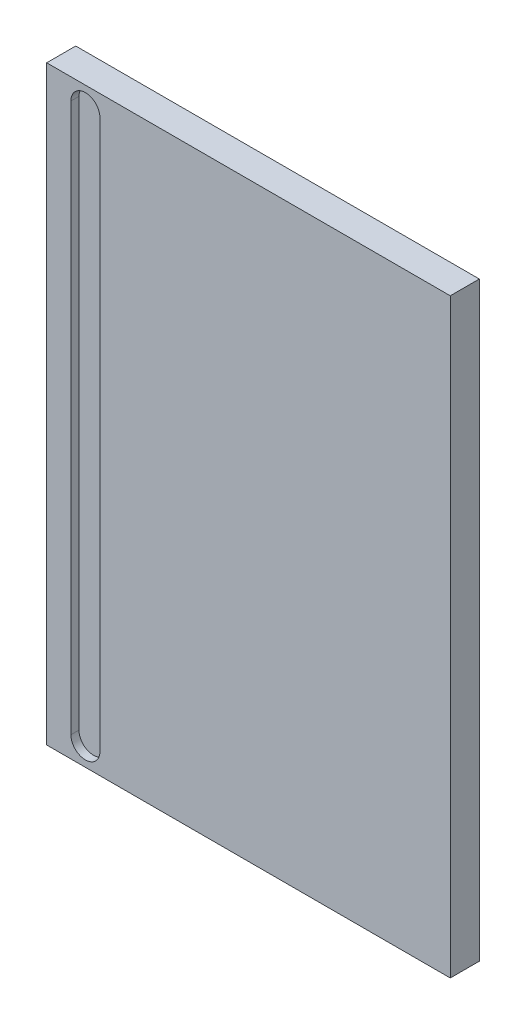
ISO-10303-21;
HEADER;
FILE_DESCRIPTION(('STEP AP214'),'2;1');
FILE_NAME('part.step','',(''),(''),'','','');
FILE_SCHEMA(('AUTOMOTIVE_DESIGN { 1 0 10303 214 1 1 1 1 }'));
ENDSEC;
DATA;
#1=APPLICATION_CONTEXT('core data for automotive mechanical design processes');
#2=APPLICATION_PROTOCOL_DEFINITION('international standard','automotive_design',2000,#1);
#3=PRODUCT_CONTEXT('',#1,'mechanical');
#4=PRODUCT('Part','Part','',(#3));
#5=PRODUCT_RELATED_PRODUCT_CATEGORY('part','',(#4));
#6=PRODUCT_DEFINITION_FORMATION('','',#4);
#7=PRODUCT_DEFINITION_CONTEXT('part definition',#1,'design');
#8=PRODUCT_DEFINITION('design','',#6,#7);
#9=PRODUCT_DEFINITION_SHAPE('','',#8);
#10=(LENGTH_UNIT() NAMED_UNIT(*) SI_UNIT(.MILLI.,.METRE.));
#11=(NAMED_UNIT(*) PLANE_ANGLE_UNIT() SI_UNIT($,.RADIAN.));
#12=(NAMED_UNIT(*) SI_UNIT($,.STERADIAN.) SOLID_ANGLE_UNIT());
#13=UNCERTAINTY_MEASURE_WITH_UNIT(LENGTH_MEASURE(1.E-05),#10,'distance_accuracy_value','');
#14=(GEOMETRIC_REPRESENTATION_CONTEXT(3) GLOBAL_UNCERTAINTY_ASSIGNED_CONTEXT((#13)) GLOBAL_UNIT_ASSIGNED_CONTEXT((#10,
#11,#12)) REPRESENTATION_CONTEXT('',''));
#15=CARTESIAN_POINT('',(0.,0.,0.));
#16=DIRECTION('',(0.,0.,1.));
#17=DIRECTION('',(1.,0.,0.));
#18=AXIS2_PLACEMENT_3D('',#15,#16,#17);
#19=CARTESIAN_POINT('',(-125.,-183.,18.));
#20=DIRECTION('',(1.,0.,0.));
#21=DIRECTION('',(0.,0.,-1.));
#22=AXIS2_PLACEMENT_3D('',#19,#20,#21);
#23=PLANE('',#22);
#24=DIRECTION('',(0.,-1.,0.));
#25=VECTOR('',#24,1.);
#26=CARTESIAN_POINT('',(-125.,-183.,0.));
#27=LINE('',#26,#25);
#28=CARTESIAN_POINT('',(-125.,183.,0.));
#29=VERTEX_POINT('',#28);
#30=CARTESIAN_POINT('',(-125.,-183.,0.));
#31=VERTEX_POINT('',#30);
#32=EDGE_CURVE('E142',#29,#31,#27,.T.);
#33=ORIENTED_EDGE('',*,*,#32,.T.);
#34=DIRECTION('',(0.,0.,-1.));
#35=VECTOR('',#34,1.);
#36=CARTESIAN_POINT('',(-125.,-183.,18.));
#37=LINE('',#36,#35);
#38=CARTESIAN_POINT('',(-125.,-183.,18.));
#39=VERTEX_POINT('',#38);
#40=EDGE_CURVE('E11',#39,#31,#37,.T.);
#41=ORIENTED_EDGE('',*,*,#40,.F.);
#42=DIRECTION('',(0.,-1.,0.));
#43=VECTOR('',#42,1.);
#44=CARTESIAN_POINT('',(-125.,-183.,18.));
#45=LINE('',#44,#43);
#46=CARTESIAN_POINT('',(-125.,183.,18.));
#47=VERTEX_POINT('',#46);
#48=EDGE_CURVE('E146',#47,#39,#45,.T.);
#49=ORIENTED_EDGE('',*,*,#48,.F.);
#50=DIRECTION('',(0.,0.,-1.));
#51=VECTOR('',#50,1.);
#52=CARTESIAN_POINT('',(-125.,183.,18.));
#53=LINE('',#52,#51);
#54=EDGE_CURVE('E152',#47,#29,#53,.T.);
#55=ORIENTED_EDGE('',*,*,#54,.T.);
#56=EDGE_LOOP('',(#33,#41,#49,#55));
#57=FACE_BOUND('',#56,.T.);
#58=ADVANCED_FACE('F34',(#57),#23,.F.);
#59=CARTESIAN_POINT('',(125.,-183.,18.));
#60=DIRECTION('',(0.,1.,0.));
#61=DIRECTION('',(-1.,0.,0.));
#62=AXIS2_PLACEMENT_3D('',#59,#60,#61);
#63=PLANE('',#62);
#64=DIRECTION('',(1.,0.,0.));
#65=VECTOR('',#64,1.);
#66=CARTESIAN_POINT('',(125.,-183.,0.));
#67=LINE('',#66,#65);
#68=CARTESIAN_POINT('',(125.,-183.,0.));
#69=VERTEX_POINT('',#68);
#70=EDGE_CURVE('E155',#31,#69,#67,.T.);
#71=ORIENTED_EDGE('',*,*,#70,.T.);
#72=DIRECTION('',(0.,0.,-1.));
#73=VECTOR('',#72,1.);
#74=CARTESIAN_POINT('',(125.,-183.,18.));
#75=LINE('',#74,#73);
#76=CARTESIAN_POINT('',(125.,-183.,18.));
#77=VERTEX_POINT('',#76);
#78=EDGE_CURVE('E41',#77,#69,#75,.T.);
#79=ORIENTED_EDGE('',*,*,#78,.F.);
#80=DIRECTION('',(1.,0.,0.));
#81=VECTOR('',#80,1.);
#82=CARTESIAN_POINT('',(125.,-183.,18.));
#83=LINE('',#82,#81);
#84=EDGE_CURVE('E85',#39,#77,#83,.T.);
#85=ORIENTED_EDGE('',*,*,#84,.F.);
#86=ORIENTED_EDGE('',*,*,#40,.T.);
#87=EDGE_LOOP('',(#71,#79,#85,#86));
#88=FACE_BOUND('',#87,.T.);
#89=ADVANCED_FACE('F184',(#88),#63,.F.);
#90=CARTESIAN_POINT('',(125.,-183.,18.));
#91=DIRECTION('',(-1.,0.,0.));
#92=DIRECTION('',(0.,0.,1.));
#93=AXIS2_PLACEMENT_3D('',#90,#91,#92);
#94=PLANE('',#93);
#95=DIRECTION('',(0.,1.,0.));
#96=VECTOR('',#95,1.);
#97=CARTESIAN_POINT('',(125.,-183.,0.));
#98=LINE('',#97,#96);
#99=CARTESIAN_POINT('',(125.,183.,0.));
#100=VERTEX_POINT('',#99);
#101=EDGE_CURVE('E157',#69,#100,#98,.T.);
#102=ORIENTED_EDGE('',*,*,#101,.T.);
#103=DIRECTION('',(0.,0.,-1.));
#104=VECTOR('',#103,1.);
#105=CARTESIAN_POINT('',(125.,183.,18.));
#106=LINE('',#105,#104);
#107=CARTESIAN_POINT('',(125.,183.,18.));
#108=VERTEX_POINT('',#107);
#109=EDGE_CURVE('E161',#108,#100,#106,.T.);
#110=ORIENTED_EDGE('',*,*,#109,.F.);
#111=DIRECTION('',(0.,1.,0.));
#112=VECTOR('',#111,1.);
#113=CARTESIAN_POINT('',(125.,-183.,18.));
#114=LINE('',#113,#112);
#115=EDGE_CURVE('E149',#77,#108,#114,.T.);
#116=ORIENTED_EDGE('',*,*,#115,.F.);
#117=ORIENTED_EDGE('',*,*,#78,.T.);
#118=EDGE_LOOP('',(#102,#110,#116,#117));
#119=FACE_BOUND('',#118,.T.);
#120=ADVANCED_FACE('F166',(#119),#94,.F.);
#121=CARTESIAN_POINT('',(125.,183.,18.));
#122=DIRECTION('',(0.,-1.,0.));
#123=DIRECTION('',(1.,0.,0.));
#124=AXIS2_PLACEMENT_3D('',#121,#122,#123);
#125=PLANE('',#124);
#126=DIRECTION('',(-1.,0.,0.));
#127=VECTOR('',#126,1.);
#128=CARTESIAN_POINT('',(125.,183.,0.));
#129=LINE('',#128,#127);
#130=EDGE_CURVE('E78',#100,#29,#129,.T.);
#131=ORIENTED_EDGE('',*,*,#130,.T.);
#132=ORIENTED_EDGE('',*,*,#54,.F.);
#133=DIRECTION('',(-1.,0.,0.));
#134=VECTOR('',#133,1.);
#135=CARTESIAN_POINT('',(125.,183.,18.));
#136=LINE('',#135,#134);
#137=EDGE_CURVE('E57',#108,#47,#136,.T.);
#138=ORIENTED_EDGE('',*,*,#137,.F.);
#139=ORIENTED_EDGE('',*,*,#109,.T.);
#140=EDGE_LOOP('',(#131,#132,#138,#139));
#141=FACE_BOUND('',#140,.T.);
#142=ADVANCED_FACE('F174',(#141),#125,.F.);
#143=CARTESIAN_POINT('',(0.,0.,18.));
#144=DIRECTION('',(0.,0.,1.));
#145=DIRECTION('',(1.,0.,0.));
#146=AXIS2_PLACEMENT_3D('',#143,#144,#145);
#147=PLANE('',#146);
#148=CARTESIAN_POINT('',(-101.,170.,18.));
#149=DIRECTION('',(0.,0.,1.));
#150=DIRECTION('',(1.,0.,0.));
#151=AXIS2_PLACEMENT_3D('',#148,#149,#150);
#152=CIRCLE('',#151,9.00000000000001);
#153=CARTESIAN_POINT('',(-92.,170.,18.));
#154=VERTEX_POINT('',#153);
#155=CARTESIAN_POINT('',(-110.,170.,18.));
#156=VERTEX_POINT('',#155);
#157=EDGE_CURVE('E48',#154,#156,#152,.T.);
#158=ORIENTED_EDGE('',*,*,#157,.F.);
#159=DIRECTION('',(0.,1.,0.));
#160=VECTOR('',#159,1.);
#161=CARTESIAN_POINT('',(-92.,170.,18.));
#162=LINE('',#161,#160);
#163=CARTESIAN_POINT('',(-91.9999999999999,-170.,18.));
#164=VERTEX_POINT('',#163);
#165=EDGE_CURVE('E127',#164,#154,#162,.T.);
#166=ORIENTED_EDGE('',*,*,#165,.F.);
#167=CARTESIAN_POINT('',(-101.,-170.,18.));
#168=DIRECTION('',(0.,0.,1.));
#169=DIRECTION('',(1.,0.,0.));
#170=AXIS2_PLACEMENT_3D('',#167,#168,#169);
#171=CIRCLE('',#170,9.);
#172=CARTESIAN_POINT('',(-110.,-170.,18.));
#173=VERTEX_POINT('',#172);
#174=EDGE_CURVE('E130',#173,#164,#171,.T.);
#175=ORIENTED_EDGE('',*,*,#174,.F.);
#176=DIRECTION('',(0.,-1.,0.));
#177=VECTOR('',#176,1.);
#178=CARTESIAN_POINT('',(-110.,170.,18.));
#179=LINE('',#178,#177);
#180=EDGE_CURVE('E136',#156,#173,#179,.T.);
#181=ORIENTED_EDGE('',*,*,#180,.F.);
#182=EDGE_LOOP('',(#158,#166,#175,#181));
#183=FACE_BOUND('',#182,.T.);
#184=ORIENTED_EDGE('',*,*,#48,.T.);
#185=ORIENTED_EDGE('',*,*,#84,.T.);
#186=ORIENTED_EDGE('',*,*,#115,.T.);
#187=ORIENTED_EDGE('',*,*,#137,.T.);
#188=EDGE_LOOP('',(#184,#185,#186,#187));
#189=FACE_BOUND('',#188,.T.);
#190=ADVANCED_FACE('F176',(#183,#189),#147,.T.);
#191=CARTESIAN_POINT('',(0.,0.,0.));
#192=DIRECTION('',(0.,0.,1.));
#193=DIRECTION('',(1.,0.,0.));
#194=AXIS2_PLACEMENT_3D('',#191,#192,#193);
#195=PLANE('',#194);
#196=ORIENTED_EDGE('',*,*,#32,.F.);
#197=ORIENTED_EDGE('',*,*,#130,.F.);
#198=ORIENTED_EDGE('',*,*,#101,.F.);
#199=ORIENTED_EDGE('',*,*,#70,.F.);
#200=EDGE_LOOP('',(#196,#197,#198,#199));
#201=FACE_BOUND('',#200,.T.);
#202=ADVANCED_FACE('F170',(#201),#195,.F.);
#203=CARTESIAN_POINT('',(-101.,170.,13.));
#204=DIRECTION('',(0.,0.,1.));
#205=DIRECTION('',(1.,0.,0.));
#206=AXIS2_PLACEMENT_3D('',#203,#204,#205);
#207=CYLINDRICAL_SURFACE('',#206,9.00000000000001);
#208=ORIENTED_EDGE('',*,*,#157,.T.);
#209=DIRECTION('',(0.,0.,1.));
#210=VECTOR('',#209,1.);
#211=CARTESIAN_POINT('',(-110.,170.,13.));
#212=LINE('',#211,#210);
#213=CARTESIAN_POINT('',(-110.,170.,13.));
#214=VERTEX_POINT('',#213);
#215=EDGE_CURVE('E105',#214,#156,#212,.T.);
#216=ORIENTED_EDGE('',*,*,#215,.F.);
#217=CARTESIAN_POINT('',(-101.,170.,13.));
#218=DIRECTION('',(0.,0.,1.));
#219=DIRECTION('',(1.,0.,0.));
#220=AXIS2_PLACEMENT_3D('',#217,#218,#219);
#221=CIRCLE('',#220,9.00000000000001);
#222=CARTESIAN_POINT('',(-92.,170.,13.));
#223=VERTEX_POINT('',#222);
#224=EDGE_CURVE('E109',#223,#214,#221,.T.);
#225=ORIENTED_EDGE('',*,*,#224,.F.);
#226=DIRECTION('',(0.,0.,1.));
#227=VECTOR('',#226,1.);
#228=CARTESIAN_POINT('',(-92.,170.,13.));
#229=LINE('',#228,#227);
#230=EDGE_CURVE('E140',#223,#154,#229,.T.);
#231=ORIENTED_EDGE('',*,*,#230,.T.);
#232=EDGE_LOOP('',(#208,#216,#225,#231));
#233=FACE_BOUND('',#232,.T.);
#234=ADVANCED_FACE('F107',(#233),#207,.F.);
#235=CARTESIAN_POINT('',(-92.,170.,13.));
#236=DIRECTION('',(1.,0.,0.));
#237=DIRECTION('',(0.,1.,0.));
#238=AXIS2_PLACEMENT_3D('',#235,#236,#237);
#239=PLANE('',#238);
#240=ORIENTED_EDGE('',*,*,#165,.T.);
#241=ORIENTED_EDGE('',*,*,#230,.F.);
#242=DIRECTION('',(0.,1.,0.));
#243=VECTOR('',#242,1.);
#244=CARTESIAN_POINT('',(-92.,170.,13.));
#245=LINE('',#244,#243);
#246=CARTESIAN_POINT('',(-91.9999999999999,-170.,13.));
#247=VERTEX_POINT('',#246);
#248=EDGE_CURVE('E115',#247,#223,#245,.T.);
#249=ORIENTED_EDGE('',*,*,#248,.F.);
#250=DIRECTION('',(0.,0.,1.));
#251=VECTOR('',#250,1.);
#252=CARTESIAN_POINT('',(-91.9999999999999,-170.,13.));
#253=LINE('',#252,#251);
#254=EDGE_CURVE('E143',#247,#164,#253,.T.);
#255=ORIENTED_EDGE('',*,*,#254,.T.);
#256=EDGE_LOOP('',(#240,#241,#249,#255));
#257=FACE_BOUND('',#256,.T.);
#258=ADVANCED_FACE('F223',(#257),#239,.F.);
#259=CARTESIAN_POINT('',(-101.,-170.,13.));
#260=DIRECTION('',(0.,0.,1.));
#261=DIRECTION('',(1.,0.,0.));
#262=AXIS2_PLACEMENT_3D('',#259,#260,#261);
#263=CYLINDRICAL_SURFACE('',#262,9.);
#264=ORIENTED_EDGE('',*,*,#174,.T.);
#265=ORIENTED_EDGE('',*,*,#254,.F.);
#266=CARTESIAN_POINT('',(-101.,-170.,13.));
#267=DIRECTION('',(0.,0.,1.));
#268=DIRECTION('',(1.,0.,0.));
#269=AXIS2_PLACEMENT_3D('',#266,#267,#268);
#270=CIRCLE('',#269,9.);
#271=CARTESIAN_POINT('',(-110.,-170.,13.));
#272=VERTEX_POINT('',#271);
#273=EDGE_CURVE('E123',#272,#247,#270,.T.);
#274=ORIENTED_EDGE('',*,*,#273,.F.);
#275=DIRECTION('',(0.,0.,1.));
#276=VECTOR('',#275,1.);
#277=CARTESIAN_POINT('',(-110.,-170.,13.));
#278=LINE('',#277,#276);
#279=EDGE_CURVE('E114',#272,#173,#278,.T.);
#280=ORIENTED_EDGE('',*,*,#279,.T.);
#281=EDGE_LOOP('',(#264,#265,#274,#280));
#282=FACE_BOUND('',#281,.T.);
#283=ADVANCED_FACE('F232',(#282),#263,.F.);
#284=CARTESIAN_POINT('',(-110.,170.,13.));
#285=DIRECTION('',(-1.,0.,0.));
#286=DIRECTION('',(0.,-1.,0.));
#287=AXIS2_PLACEMENT_3D('',#284,#285,#286);
#288=PLANE('',#287);
#289=ORIENTED_EDGE('',*,*,#180,.T.);
#290=ORIENTED_EDGE('',*,*,#279,.F.);
#291=DIRECTION('',(0.,-1.,0.));
#292=VECTOR('',#291,1.);
#293=CARTESIAN_POINT('',(-110.,170.,13.));
#294=LINE('',#293,#292);
#295=EDGE_CURVE('E118',#214,#272,#294,.T.);
#296=ORIENTED_EDGE('',*,*,#295,.F.);
#297=ORIENTED_EDGE('',*,*,#215,.T.);
#298=EDGE_LOOP('',(#289,#290,#296,#297));
#299=FACE_BOUND('',#298,.T.);
#300=ADVANCED_FACE('F119',(#299),#288,.F.);
#301=CARTESIAN_POINT('',(-101.,170.,13.));
#302=DIRECTION('',(0.,0.,1.));
#303=DIRECTION('',(1.,0.,0.));
#304=AXIS2_PLACEMENT_3D('',#301,#302,#303);
#305=PLANE('',#304);
#306=ORIENTED_EDGE('',*,*,#224,.T.);
#307=ORIENTED_EDGE('',*,*,#295,.T.);
#308=ORIENTED_EDGE('',*,*,#273,.T.);
#309=ORIENTED_EDGE('',*,*,#248,.T.);
#310=EDGE_LOOP('',(#306,#307,#308,#309));
#311=FACE_BOUND('',#310,.T.);
#312=ADVANCED_FACE('F125',(#311),#305,.T.);
#313=CLOSED_SHELL('',(#58,#89,#120,#142,#190,#202,#234,#258,#283,#300,#312));
#314=MANIFOLD_SOLID_BREP('B2',#313);
#315=ADVANCED_BREP_SHAPE_REPRESENTATION('',(#18,#314),#14);
#316=SHAPE_DEFINITION_REPRESENTATION(#9,#315);
ENDSEC;
END-ISO-10303-21;
